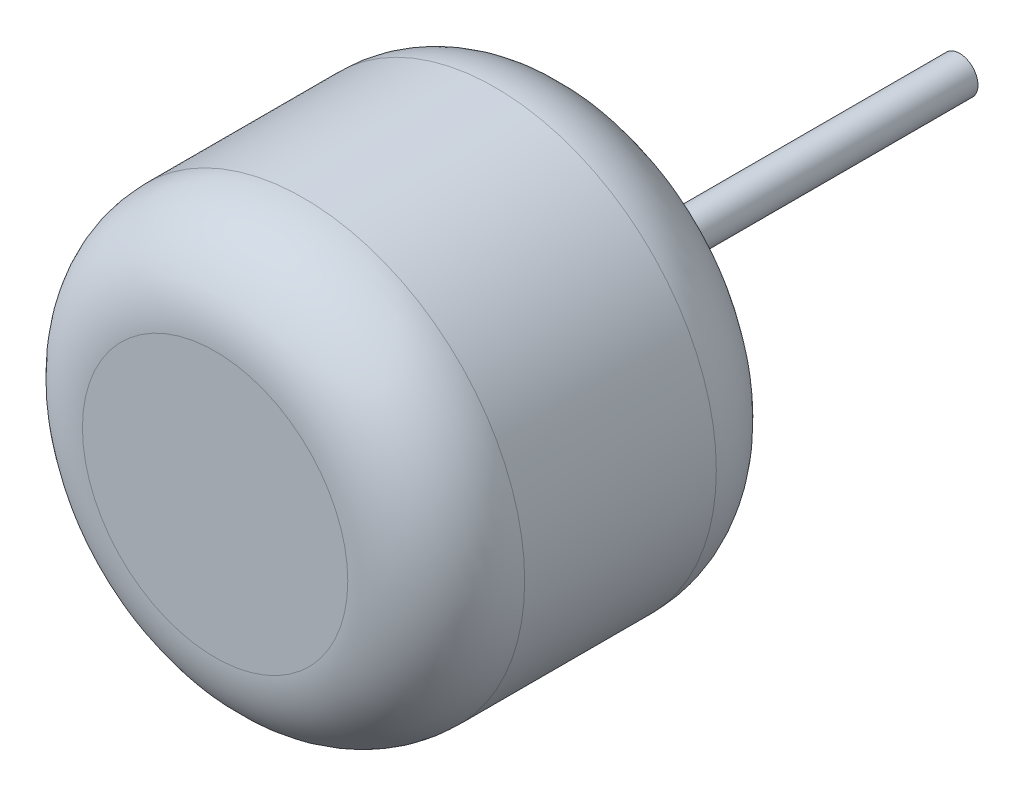
ISO-10303-21;
HEADER;
FILE_DESCRIPTION(('STEP AP214'),'2;1');
FILE_NAME('part.step','',(''),(''),'','','');
FILE_SCHEMA(('AUTOMOTIVE_DESIGN { 1 0 10303 214 1 1 1 1 }'));
ENDSEC;
DATA;
#1=APPLICATION_CONTEXT('core data for automotive mechanical design processes');
#2=APPLICATION_PROTOCOL_DEFINITION('international standard','automotive_design',2000,#1);
#3=PRODUCT_CONTEXT('',#1,'mechanical');
#4=PRODUCT('Part','Part','',(#3));
#5=PRODUCT_RELATED_PRODUCT_CATEGORY('part','',(#4));
#6=PRODUCT_DEFINITION_FORMATION('','',#4);
#7=PRODUCT_DEFINITION_CONTEXT('part definition',#1,'design');
#8=PRODUCT_DEFINITION('design','',#6,#7);
#9=PRODUCT_DEFINITION_SHAPE('','',#8);
#10=(LENGTH_UNIT() NAMED_UNIT(*) SI_UNIT(.MILLI.,.METRE.));
#11=(NAMED_UNIT(*) PLANE_ANGLE_UNIT() SI_UNIT($,.RADIAN.));
#12=(NAMED_UNIT(*) SI_UNIT($,.STERADIAN.) SOLID_ANGLE_UNIT());
#13=UNCERTAINTY_MEASURE_WITH_UNIT(LENGTH_MEASURE(1.E-05),#10,'distance_accuracy_value','');
#14=(GEOMETRIC_REPRESENTATION_CONTEXT(3) GLOBAL_UNCERTAINTY_ASSIGNED_CONTEXT((#13)) GLOBAL_UNIT_ASSIGNED_CONTEXT((#10,
#11,#12)) REPRESENTATION_CONTEXT('',''));
#15=CARTESIAN_POINT('',(0.,0.,0.));
#16=DIRECTION('',(0.,0.,1.));
#17=DIRECTION('',(1.,0.,0.));
#18=AXIS2_PLACEMENT_3D('',#15,#16,#17);
#19=CARTESIAN_POINT('',(0.,0.,250.));
#20=DIRECTION('',(0.,0.,-1.));
#21=DIRECTION('',(-1.,0.,0.));
#22=AXIS2_PLACEMENT_3D('',#19,#20,#21);
#23=CYLINDRICAL_SURFACE('',#22,150.);
#24=CARTESIAN_POINT('',(0.,0.,60.));
#25=DIRECTION('',(0.,0.,1.));
#26=DIRECTION('',(1.,0.,0.));
#27=AXIS2_PLACEMENT_3D('',#24,#25,#26);
#28=CIRCLE('',#27,150.);
#29=CARTESIAN_POINT('',(150.,0.,60.));
#30=VERTEX_POINT('',#29);
#31=EDGE_CURVE('E50',#30,#30,#28,.T.);
#32=ORIENTED_EDGE('',*,*,#31,.T.);
#33=EDGE_LOOP('',(#32));
#34=FACE_BOUND('',#33,.T.);
#35=CARTESIAN_POINT('',(0.,0.,190.));
#36=DIRECTION('',(0.,0.,1.));
#37=DIRECTION('',(1.,0.,0.));
#38=AXIS2_PLACEMENT_3D('',#35,#36,#37);
#39=CIRCLE('',#38,150.);
#40=CARTESIAN_POINT('',(150.,0.,190.));
#41=VERTEX_POINT('',#40);
#42=EDGE_CURVE('E55',#41,#41,#39,.F.);
#43=ORIENTED_EDGE('',*,*,#42,.T.);
#44=EDGE_LOOP('',(#43));
#45=FACE_BOUND('',#44,.T.);
#46=ADVANCED_FACE('F37',(#34,#45),#23,.T.);
#47=CARTESIAN_POINT('',(0.,0.,250.));
#48=DIRECTION('',(0.,0.,1.));
#49=DIRECTION('',(1.,0.,0.));
#50=AXIS2_PLACEMENT_3D('',#47,#48,#49);
#51=PLANE('',#50);
#52=CARTESIAN_POINT('',(0.,0.,250.));
#53=DIRECTION('',(0.,0.,1.));
#54=DIRECTION('',(1.,0.,0.));
#55=AXIS2_PLACEMENT_3D('',#52,#53,#54);
#56=CIRCLE('',#55,90.);
#57=CARTESIAN_POINT('',(90.,0.,250.));
#58=VERTEX_POINT('',#57);
#59=EDGE_CURVE('E10',#58,#58,#56,.T.);
#60=ORIENTED_EDGE('',*,*,#59,.T.);
#61=EDGE_LOOP('',(#60));
#62=FACE_BOUND('',#61,.T.);
#63=ADVANCED_FACE('F80',(#62),#51,.T.);
#64=CARTESIAN_POINT('',(0.,0.,0.));
#65=DIRECTION('',(0.,0.,1.));
#66=DIRECTION('',(1.,0.,0.));
#67=AXIS2_PLACEMENT_3D('',#64,#65,#66);
#68=PLANE('',#67);
#69=CARTESIAN_POINT('',(0.,0.,0.));
#70=DIRECTION('',(0.,0.,1.));
#71=DIRECTION('',(1.,0.,0.));
#72=AXIS2_PLACEMENT_3D('',#69,#70,#71);
#73=CIRCLE('',#72,90.);
#74=CARTESIAN_POINT('',(90.,0.,0.));
#75=VERTEX_POINT('',#74);
#76=EDGE_CURVE('E45',#75,#75,#73,.F.);
#77=ORIENTED_EDGE('',*,*,#76,.T.);
#78=EDGE_LOOP('',(#77));
#79=FACE_BOUND('',#78,.T.);
#80=CARTESIAN_POINT('',(0.,0.,0.));
#81=DIRECTION('',(0.,0.,1.));
#82=DIRECTION('',(1.,0.,0.));
#83=AXIS2_PLACEMENT_3D('',#80,#81,#82);
#84=CIRCLE('',#83,12.5);
#85=CARTESIAN_POINT('',(12.5,0.,0.));
#86=VERTEX_POINT('',#85);
#87=EDGE_CURVE('E61',#86,#86,#84,.F.);
#88=ORIENTED_EDGE('',*,*,#87,.F.);
#89=EDGE_LOOP('',(#88));
#90=FACE_BOUND('',#89,.T.);
#91=ADVANCED_FACE('F75',(#79,#90),#68,.F.);
#92=CARTESIAN_POINT('',(0.,0.,-255.));
#93=DIRECTION('',(0.,0.,1.));
#94=DIRECTION('',(1.,0.,0.));
#95=AXIS2_PLACEMENT_3D('',#92,#93,#94);
#96=CYLINDRICAL_SURFACE('',#95,12.5);
#97=CARTESIAN_POINT('',(0.,0.,-255.));
#98=DIRECTION('',(0.,0.,-1.));
#99=DIRECTION('',(-1.,0.,0.));
#100=AXIS2_PLACEMENT_3D('',#97,#98,#99);
#101=CIRCLE('',#100,12.5);
#102=CARTESIAN_POINT('',(-12.5,0.,-255.));
#103=VERTEX_POINT('',#102);
#104=EDGE_CURVE('E65',#103,#103,#101,.T.);
#105=ORIENTED_EDGE('',*,*,#104,.F.);
#106=EDGE_LOOP('',(#105));
#107=FACE_BOUND('',#106,.T.);
#108=ORIENTED_EDGE('',*,*,#87,.T.);
#109=EDGE_LOOP('',(#108));
#110=FACE_BOUND('',#109,.T.);
#111=ADVANCED_FACE('F72',(#107,#110),#96,.T.);
#112=CARTESIAN_POINT('',(0.,0.,-255.));
#113=DIRECTION('',(0.,0.,-1.));
#114=DIRECTION('',(-1.,0.,0.));
#115=AXIS2_PLACEMENT_3D('',#112,#113,#114);
#116=PLANE('',#115);
#117=ORIENTED_EDGE('',*,*,#104,.T.);
#118=EDGE_LOOP('',(#117));
#119=FACE_BOUND('',#118,.T.);
#120=ADVANCED_FACE('F70',(#119),#116,.T.);
#121=CARTESIAN_POINT('',(0.,0.,60.));
#122=DIRECTION('',(0.,0.,1.));
#123=DIRECTION('',(1.,0.,0.));
#124=AXIS2_PLACEMENT_3D('',#121,#122,#123);
#125=TOROIDAL_SURFACE('',#124,90.,60.);
#126=ORIENTED_EDGE('',*,*,#76,.F.);
#127=EDGE_LOOP('',(#126));
#128=FACE_BOUND('',#127,.T.);
#129=ORIENTED_EDGE('',*,*,#31,.F.);
#130=EDGE_LOOP('',(#129));
#131=FACE_BOUND('',#130,.T.);
#132=ADVANCED_FACE('F92',(#128,#131),#125,.T.);
#133=CARTESIAN_POINT('',(0.,0.,190.));
#134=DIRECTION('',(0.,0.,1.));
#135=DIRECTION('',(1.,0.,0.));
#136=AXIS2_PLACEMENT_3D('',#133,#134,#135);
#137=TOROIDAL_SURFACE('',#136,90.,60.);
#138=ORIENTED_EDGE('',*,*,#42,.F.);
#139=EDGE_LOOP('',(#138));
#140=FACE_BOUND('',#139,.T.);
#141=ORIENTED_EDGE('',*,*,#59,.F.);
#142=EDGE_LOOP('',(#141));
#143=FACE_BOUND('',#142,.T.);
#144=ADVANCED_FACE('F39',(#140,#143),#137,.T.);
#145=CLOSED_SHELL('',(#46,#63,#91,#111,#120,#132,#144));
#146=MANIFOLD_SOLID_BREP('B2',#145);
#147=ADVANCED_BREP_SHAPE_REPRESENTATION('',(#18,#146),#14);
#148=SHAPE_DEFINITION_REPRESENTATION(#9,#147);
ENDSEC;
END-ISO-10303-21;
